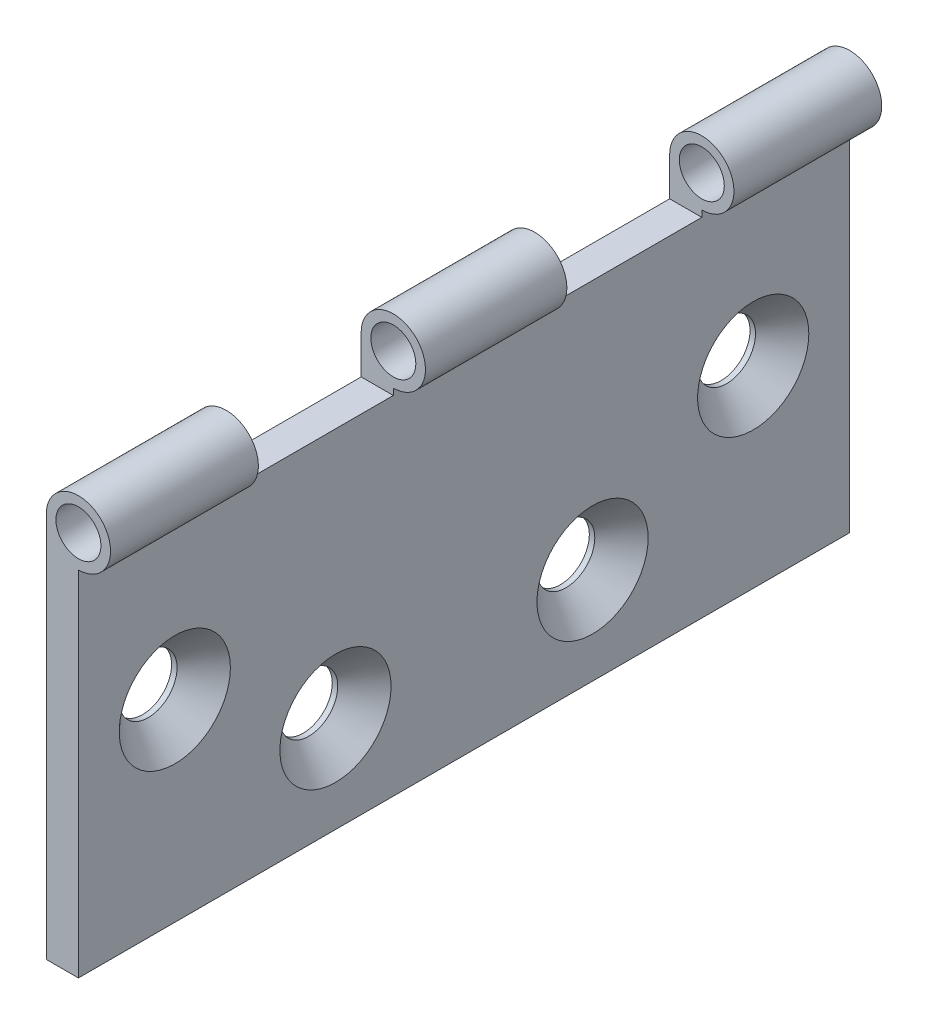
ISO-10303-21;
HEADER;
FILE_DESCRIPTION(('STEP AP214'),'2;1');
FILE_NAME('part.step','',(''),(''),'','','');
FILE_SCHEMA(('AUTOMOTIVE_DESIGN { 1 0 10303 214 1 1 1 1 }'));
ENDSEC;
DATA;
#1=APPLICATION_CONTEXT('core data for automotive mechanical design processes');
#2=APPLICATION_PROTOCOL_DEFINITION('international standard','automotive_design',2000,#1);
#3=PRODUCT_CONTEXT('',#1,'mechanical');
#4=PRODUCT('Part','Part','',(#3));
#5=PRODUCT_RELATED_PRODUCT_CATEGORY('part','',(#4));
#6=PRODUCT_DEFINITION_FORMATION('','',#4);
#7=PRODUCT_DEFINITION_CONTEXT('part definition',#1,'design');
#8=PRODUCT_DEFINITION('design','',#6,#7);
#9=PRODUCT_DEFINITION_SHAPE('','',#8);
#10=(LENGTH_UNIT() NAMED_UNIT(*) SI_UNIT(.MILLI.,.METRE.));
#11=(NAMED_UNIT(*) PLANE_ANGLE_UNIT() SI_UNIT($,.RADIAN.));
#12=(NAMED_UNIT(*) SI_UNIT($,.STERADIAN.) SOLID_ANGLE_UNIT());
#13=UNCERTAINTY_MEASURE_WITH_UNIT(LENGTH_MEASURE(1.E-05),#10,'distance_accuracy_value','');
#14=(GEOMETRIC_REPRESENTATION_CONTEXT(3) GLOBAL_UNCERTAINTY_ASSIGNED_CONTEXT((#13)) GLOBAL_UNIT_ASSIGNED_CONTEXT((#10,
#11,#12)) REPRESENTATION_CONTEXT('',''));
#15=CARTESIAN_POINT('',(0.,0.,0.));
#16=DIRECTION('',(0.,0.,1.));
#17=DIRECTION('',(1.,0.,0.));
#18=AXIS2_PLACEMENT_3D('',#15,#16,#17);
#19=CARTESIAN_POINT('',(5.,60.,60.));
#20=DIRECTION('',(0.,0.,-1.));
#21=DIRECTION('',(-1.,0.,0.));
#22=AXIS2_PLACEMENT_3D('',#19,#20,#21);
#23=CYLINDRICAL_SURFACE('',#22,5.);
#24=CARTESIAN_POINT('',(5.,60.,-37.));
#25=DIRECTION('',(0.,0.,-1.));
#26=DIRECTION('',(-1.,0.,0.));
#27=AXIS2_PLACEMENT_3D('',#24,#25,#26);
#28=CIRCLE('',#27,5.);
#29=CARTESIAN_POINT('',(5.,55.,-37.));
#30=VERTEX_POINT('',#29);
#31=CARTESIAN_POINT('',(0.,60.,-37.));
#32=VERTEX_POINT('',#31);
#33=EDGE_CURVE('E139',#30,#32,#28,.F.);
#34=ORIENTED_EDGE('',*,*,#33,.F.);
#35=DIRECTION('',(0.,0.,-1.));
#36=VECTOR('',#35,1.);
#37=CARTESIAN_POINT('',(5.,55.,60.));
#38=LINE('',#37,#36);
#39=CARTESIAN_POINT('',(5.,55.,-60.));
#40=VERTEX_POINT('',#39);
#41=EDGE_CURVE('E94',#40,#30,#38,.F.);
#42=ORIENTED_EDGE('',*,*,#41,.F.);
#43=CARTESIAN_POINT('',(5.,60.,-60.));
#44=DIRECTION('',(0.,0.,-1.));
#45=DIRECTION('',(-1.,0.,0.));
#46=AXIS2_PLACEMENT_3D('',#43,#44,#45);
#47=CIRCLE('',#46,5.);
#48=CARTESIAN_POINT('',(0.,60.,-60.));
#49=VERTEX_POINT('',#48);
#50=EDGE_CURVE('E92',#49,#40,#47,.T.);
#51=ORIENTED_EDGE('',*,*,#50,.F.);
#52=DIRECTION('',(0.,0.,-1.));
#53=VECTOR('',#52,1.);
#54=CARTESIAN_POINT('',(0.,60.,60.));
#55=LINE('',#54,#53);
#56=EDGE_CURVE('E44',#32,#49,#55,.T.);
#57=ORIENTED_EDGE('',*,*,#56,.F.);
#58=EDGE_LOOP('',(#34,#42,#51,#57));
#59=FACE_BOUND('',#58,.T.);
#60=ADVANCED_FACE('F33',(#59),#23,.T.);
#61=CARTESIAN_POINT('',(5.,60.,-60.));
#62=DIRECTION('',(0.,0.,1.));
#63=DIRECTION('',(1.,0.,0.));
#64=AXIS2_PLACEMENT_3D('',#61,#62,#63);
#65=CYLINDRICAL_SURFACE('',#64,3.5);
#66=CARTESIAN_POINT('',(5.,60.,-37.));
#67=DIRECTION('',(0.,0.,-1.));
#68=DIRECTION('',(-1.,0.,0.));
#69=AXIS2_PLACEMENT_3D('',#66,#67,#68);
#70=CIRCLE('',#69,3.5);
#71=CARTESIAN_POINT('',(1.5,60.,-37.));
#72=VERTEX_POINT('',#71);
#73=EDGE_CURVE('E37',#72,#72,#70,.F.);
#74=ORIENTED_EDGE('',*,*,#73,.T.);
#75=EDGE_LOOP('',(#74));
#76=FACE_BOUND('',#75,.T.);
#77=CARTESIAN_POINT('',(5.,60.,-60.));
#78=DIRECTION('',(0.,0.,1.));
#79=DIRECTION('',(1.,0.,0.));
#80=AXIS2_PLACEMENT_3D('',#77,#78,#79);
#81=CIRCLE('',#80,3.5);
#82=CARTESIAN_POINT('',(8.5,60.,-60.));
#83=VERTEX_POINT('',#82);
#84=EDGE_CURVE('E208',#83,#83,#81,.T.);
#85=ORIENTED_EDGE('',*,*,#84,.F.);
#86=EDGE_LOOP('',(#85));
#87=FACE_BOUND('',#86,.T.);
#88=ADVANCED_FACE('F315',(#76,#87),#65,.F.);
#89=CARTESIAN_POINT('',(5.,55.,-11.));
#90=VERTEX_POINT('',#89);
#91=CARTESIAN_POINT('',(5.,55.,11.));
#92=VERTEX_POINT('',#91);
#93=EDGE_CURVE('E218',#90,#92,#38,.F.);
#94=ORIENTED_EDGE('',*,*,#93,.F.);
#95=CARTESIAN_POINT('',(5.,60.,-11.));
#96=DIRECTION('',(0.,0.,1.));
#97=DIRECTION('',(1.,0.,0.));
#98=AXIS2_PLACEMENT_3D('',#95,#96,#97);
#99=CIRCLE('',#98,5.);
#100=CARTESIAN_POINT('',(0.,60.,-11.));
#101=VERTEX_POINT('',#100);
#102=EDGE_CURVE('E120',#101,#90,#99,.F.);
#103=ORIENTED_EDGE('',*,*,#102,.F.);
#104=CARTESIAN_POINT('',(0.,60.,11.));
#105=VERTEX_POINT('',#104);
#106=EDGE_CURVE('E42',#105,#101,#55,.T.);
#107=ORIENTED_EDGE('',*,*,#106,.F.);
#108=CARTESIAN_POINT('',(5.,60.,11.));
#109=DIRECTION('',(0.,0.,-1.));
#110=DIRECTION('',(-1.,0.,0.));
#111=AXIS2_PLACEMENT_3D('',#108,#109,#110);
#112=CIRCLE('',#111,5.);
#113=EDGE_CURVE('E107',#92,#105,#112,.F.);
#114=ORIENTED_EDGE('',*,*,#113,.F.);
#115=EDGE_LOOP('',(#94,#103,#107,#114));
#116=FACE_BOUND('',#115,.T.);
#117=ADVANCED_FACE('F281',(#116),#23,.T.);
#118=CARTESIAN_POINT('',(5.,60.,37.));
#119=DIRECTION('',(0.,0.,1.));
#120=DIRECTION('',(1.,0.,0.));
#121=AXIS2_PLACEMENT_3D('',#118,#119,#120);
#122=CIRCLE('',#121,3.5);
#123=CARTESIAN_POINT('',(8.5,60.,37.));
#124=VERTEX_POINT('',#123);
#125=EDGE_CURVE('E109',#124,#124,#122,.F.);
#126=ORIENTED_EDGE('',*,*,#125,.T.);
#127=EDGE_LOOP('',(#126));
#128=FACE_BOUND('',#127,.T.);
#129=CARTESIAN_POINT('',(5.,60.,60.));
#130=DIRECTION('',(0.,0.,1.));
#131=DIRECTION('',(1.,0.,0.));
#132=AXIS2_PLACEMENT_3D('',#129,#130,#131);
#133=CIRCLE('',#132,3.5);
#134=CARTESIAN_POINT('',(8.5,60.,60.));
#135=VERTEX_POINT('',#134);
#136=EDGE_CURVE('E207',#135,#135,#133,.T.);
#137=ORIENTED_EDGE('',*,*,#136,.T.);
#138=EDGE_LOOP('',(#137));
#139=FACE_BOUND('',#138,.T.);
#140=ADVANCED_FACE('F322',(#128,#139),#65,.F.);
#141=CARTESIAN_POINT('',(5.,0.,60.));
#142=DIRECTION('',(-1.,0.,0.));
#143=DIRECTION('',(0.,0.,1.));
#144=AXIS2_PLACEMENT_3D('',#141,#142,#143);
#145=PLANE('',#144);
#146=CARTESIAN_POINT('',(5.,30.,-45.));
#147=DIRECTION('',(1.,0.,0.));
#148=DIRECTION('',(0.,0.,-1.));
#149=AXIS2_PLACEMENT_3D('',#146,#147,#148);
#150=CIRCLE('',#149,8.65);
#151=CARTESIAN_POINT('',(5.,30.,-53.65));
#152=VERTEX_POINT('',#151);
#153=EDGE_CURVE('E171',#152,#152,#150,.T.);
#154=ORIENTED_EDGE('',*,*,#153,.F.);
#155=EDGE_LOOP('',(#154));
#156=FACE_BOUND('',#155,.T.);
#157=CARTESIAN_POINT('',(5.,15.,-20.));
#158=DIRECTION('',(1.,0.,0.));
#159=DIRECTION('',(0.,0.,-1.));
#160=AXIS2_PLACEMENT_3D('',#157,#158,#159);
#161=CIRCLE('',#160,8.65);
#162=CARTESIAN_POINT('',(5.,15.,-28.65));
#163=VERTEX_POINT('',#162);
#164=EDGE_CURVE('E180',#163,#163,#161,.T.);
#165=ORIENTED_EDGE('',*,*,#164,.F.);
#166=EDGE_LOOP('',(#165));
#167=FACE_BOUND('',#166,.T.);
#168=CARTESIAN_POINT('',(5.,30.,45.));
#169=DIRECTION('',(1.,0.,0.));
#170=DIRECTION('',(0.,0.,-1.));
#171=AXIS2_PLACEMENT_3D('',#168,#169,#170);
#172=CIRCLE('',#171,8.65);
#173=CARTESIAN_POINT('',(5.,30.,36.35));
#174=VERTEX_POINT('',#173);
#175=EDGE_CURVE('E189',#174,#174,#172,.T.);
#176=ORIENTED_EDGE('',*,*,#175,.F.);
#177=EDGE_LOOP('',(#176));
#178=FACE_BOUND('',#177,.T.);
#179=CARTESIAN_POINT('',(5.,15.,20.));
#180=DIRECTION('',(1.,0.,0.));
#181=DIRECTION('',(0.,0.,-1.));
#182=AXIS2_PLACEMENT_3D('',#179,#180,#181);
#183=CIRCLE('',#182,8.65);
#184=CARTESIAN_POINT('',(5.,15.,11.35));
#185=VERTEX_POINT('',#184);
#186=EDGE_CURVE('E198',#185,#185,#183,.T.);
#187=ORIENTED_EDGE('',*,*,#186,.F.);
#188=EDGE_LOOP('',(#187));
#189=FACE_BOUND('',#188,.T.);
#190=ORIENTED_EDGE('',*,*,#41,.T.);
#191=DIRECTION('',(0.,-1.,0.));
#192=VECTOR('',#191,1.);
#193=CARTESIAN_POINT('',(5.,0.,-37.));
#194=LINE('',#193,#192);
#195=CARTESIAN_POINT('',(5.,54.,-37.));
#196=VERTEX_POINT('',#195);
#197=EDGE_CURVE('E137',#30,#196,#194,.T.);
#198=ORIENTED_EDGE('',*,*,#197,.T.);
#199=DIRECTION('',(0.,0.,1.));
#200=VECTOR('',#199,1.);
#201=CARTESIAN_POINT('',(5.,54.,60.));
#202=LINE('',#201,#200);
#203=CARTESIAN_POINT('',(5.,54.,-11.));
#204=VERTEX_POINT('',#203);
#205=EDGE_CURVE('E142',#196,#204,#202,.T.);
#206=ORIENTED_EDGE('',*,*,#205,.T.);
#207=DIRECTION('',(0.,1.,0.));
#208=VECTOR('',#207,1.);
#209=CARTESIAN_POINT('',(5.,0.,-11.));
#210=LINE('',#209,#208);
#211=EDGE_CURVE('E115',#204,#90,#210,.T.);
#212=ORIENTED_EDGE('',*,*,#211,.T.);
#213=ORIENTED_EDGE('',*,*,#93,.T.);
#214=DIRECTION('',(0.,-1.,0.));
#215=VECTOR('',#214,1.);
#216=CARTESIAN_POINT('',(5.,0.,11.));
#217=LINE('',#216,#215);
#218=CARTESIAN_POINT('',(5.,54.,11.));
#219=VERTEX_POINT('',#218);
#220=EDGE_CURVE('E112',#92,#219,#217,.T.);
#221=ORIENTED_EDGE('',*,*,#220,.T.);
#222=DIRECTION('',(0.,0.,1.));
#223=VECTOR('',#222,1.);
#224=CARTESIAN_POINT('',(5.,54.,60.));
#225=LINE('',#224,#223);
#226=CARTESIAN_POINT('',(5.,54.,37.));
#227=VERTEX_POINT('',#226);
#228=EDGE_CURVE('E168',#219,#227,#225,.T.);
#229=ORIENTED_EDGE('',*,*,#228,.T.);
#230=DIRECTION('',(0.,1.,0.));
#231=VECTOR('',#230,1.);
#232=CARTESIAN_POINT('',(5.,0.,37.));
#233=LINE('',#232,#231);
#234=CARTESIAN_POINT('',(5.,55.,37.));
#235=VERTEX_POINT('',#234);
#236=EDGE_CURVE('E165',#227,#235,#233,.T.);
#237=ORIENTED_EDGE('',*,*,#236,.T.);
#238=CARTESIAN_POINT('',(5.,55.,60.));
#239=VERTEX_POINT('',#238);
#240=EDGE_CURVE('E216',#235,#239,#38,.F.);
#241=ORIENTED_EDGE('',*,*,#240,.T.);
#242=DIRECTION('',(0.,1.,0.));
#243=VECTOR('',#242,1.);
#244=CARTESIAN_POINT('',(5.,0.,60.));
#245=LINE('',#244,#243);
#246=CARTESIAN_POINT('',(5.,0.,60.));
#247=VERTEX_POINT('',#246);
#248=EDGE_CURVE('E80',#247,#239,#245,.T.);
#249=ORIENTED_EDGE('',*,*,#248,.F.);
#250=DIRECTION('',(0.,0.,-1.));
#251=VECTOR('',#250,1.);
#252=CARTESIAN_POINT('',(5.,0.,60.));
#253=LINE('',#252,#251);
#254=CARTESIAN_POINT('',(5.,0.,-60.));
#255=VERTEX_POINT('',#254);
#256=EDGE_CURVE('E60',#247,#255,#253,.T.);
#257=ORIENTED_EDGE('',*,*,#256,.T.);
#258=DIRECTION('',(0.,1.,0.));
#259=VECTOR('',#258,1.);
#260=CARTESIAN_POINT('',(5.,0.,-60.));
#261=LINE('',#260,#259);
#262=EDGE_CURVE('E77',#255,#40,#261,.T.);
#263=ORIENTED_EDGE('',*,*,#262,.T.);
#264=EDGE_LOOP('',(#190,#198,#206,#212,#213,#221,#229,#237,#241,#249,#257,#263));
#265=FACE_BOUND('',#264,.T.);
#266=ADVANCED_FACE('F35',(#156,#167,#178,#189,#265),#145,.F.);
#267=CARTESIAN_POINT('',(0.,0.,60.));
#268=DIRECTION('',(-1.,0.,0.));
#269=DIRECTION('',(0.,0.,1.));
#270=AXIS2_PLACEMENT_3D('',#267,#268,#269);
#271=PLANE('',#270);
#272=DIRECTION('',(0.,1.,0.));
#273=VECTOR('',#272,1.);
#274=CARTESIAN_POINT('',(0.,65.,-37.));
#275=LINE('',#274,#273);
#276=CARTESIAN_POINT('',(0.,54.,-37.));
#277=VERTEX_POINT('',#276);
#278=EDGE_CURVE('E130',#277,#32,#275,.T.);
#279=ORIENTED_EDGE('',*,*,#278,.T.);
#280=ORIENTED_EDGE('',*,*,#56,.T.);
#281=DIRECTION('',(0.,1.,0.));
#282=VECTOR('',#281,1.);
#283=CARTESIAN_POINT('',(0.,0.,-60.));
#284=LINE('',#283,#282);
#285=CARTESIAN_POINT('',(0.,0.,-60.));
#286=VERTEX_POINT('',#285);
#287=EDGE_CURVE('E93',#286,#49,#284,.T.);
#288=ORIENTED_EDGE('',*,*,#287,.F.);
#289=DIRECTION('',(0.,0.,-1.));
#290=VECTOR('',#289,1.);
#291=CARTESIAN_POINT('',(0.,0.,60.));
#292=LINE('',#291,#290);
#293=CARTESIAN_POINT('',(0.,0.,60.));
#294=VERTEX_POINT('',#293);
#295=EDGE_CURVE('E82',#294,#286,#292,.T.);
#296=ORIENTED_EDGE('',*,*,#295,.F.);
#297=DIRECTION('',(0.,1.,0.));
#298=VECTOR('',#297,1.);
#299=CARTESIAN_POINT('',(0.,0.,60.));
#300=LINE('',#299,#298);
#301=CARTESIAN_POINT('',(0.,60.,60.));
#302=VERTEX_POINT('',#301);
#303=EDGE_CURVE('E99',#294,#302,#300,.T.);
#304=ORIENTED_EDGE('',*,*,#303,.T.);
#305=CARTESIAN_POINT('',(0.,60.,37.));
#306=VERTEX_POINT('',#305);
#307=EDGE_CURVE('E11',#302,#306,#55,.T.);
#308=ORIENTED_EDGE('',*,*,#307,.T.);
#309=DIRECTION('',(0.,-1.,0.));
#310=VECTOR('',#309,1.);
#311=CARTESIAN_POINT('',(0.,65.,37.));
#312=LINE('',#311,#310);
#313=CARTESIAN_POINT('',(0.,54.,37.));
#314=VERTEX_POINT('',#313);
#315=EDGE_CURVE('E145',#306,#314,#312,.T.);
#316=ORIENTED_EDGE('',*,*,#315,.T.);
#317=DIRECTION('',(0.,0.,-1.));
#318=VECTOR('',#317,1.);
#319=CARTESIAN_POINT('',(0.,54.,11.));
#320=LINE('',#319,#318);
#321=CARTESIAN_POINT('',(0.,54.,11.));
#322=VERTEX_POINT('',#321);
#323=EDGE_CURVE('E148',#314,#322,#320,.T.);
#324=ORIENTED_EDGE('',*,*,#323,.T.);
#325=DIRECTION('',(0.,1.,0.));
#326=VECTOR('',#325,1.);
#327=CARTESIAN_POINT('',(0.,65.,11.));
#328=LINE('',#327,#326);
#329=EDGE_CURVE('E151',#322,#105,#328,.T.);
#330=ORIENTED_EDGE('',*,*,#329,.T.);
#331=ORIENTED_EDGE('',*,*,#106,.T.);
#332=DIRECTION('',(0.,-1.,0.));
#333=VECTOR('',#332,1.);
#334=CARTESIAN_POINT('',(0.,65.,-11.));
#335=LINE('',#334,#333);
#336=CARTESIAN_POINT('',(0.,54.,-11.));
#337=VERTEX_POINT('',#336);
#338=EDGE_CURVE('E291',#101,#337,#335,.T.);
#339=ORIENTED_EDGE('',*,*,#338,.T.);
#340=DIRECTION('',(0.,0.,-1.));
#341=VECTOR('',#340,1.);
#342=CARTESIAN_POINT('',(0.,54.,-37.));
#343=LINE('',#342,#341);
#344=EDGE_CURVE('E51',#337,#277,#343,.T.);
#345=ORIENTED_EDGE('',*,*,#344,.T.);
#346=EDGE_LOOP('',(#279,#280,#288,#296,#304,#308,#316,#324,#330,#331,#339,#345));
#347=FACE_BOUND('',#346,.T.);
#348=CARTESIAN_POINT('',(0.,30.,-45.));
#349=DIRECTION('',(1.,0.,0.));
#350=DIRECTION('',(0.,0.,-1.));
#351=AXIS2_PLACEMENT_3D('',#348,#349,#350);
#352=CIRCLE('',#351,4.5);
#353=CARTESIAN_POINT('',(0.,30.,-49.5));
#354=VERTEX_POINT('',#353);
#355=EDGE_CURVE('E177',#354,#354,#352,.T.);
#356=ORIENTED_EDGE('',*,*,#355,.T.);
#357=EDGE_LOOP('',(#356));
#358=FACE_BOUND('',#357,.T.);
#359=CARTESIAN_POINT('',(0.,15.,-20.));
#360=DIRECTION('',(1.,0.,0.));
#361=DIRECTION('',(0.,0.,-1.));
#362=AXIS2_PLACEMENT_3D('',#359,#360,#361);
#363=CIRCLE('',#362,4.5);
#364=CARTESIAN_POINT('',(0.,15.,-24.5));
#365=VERTEX_POINT('',#364);
#366=EDGE_CURVE('E186',#365,#365,#363,.T.);
#367=ORIENTED_EDGE('',*,*,#366,.T.);
#368=EDGE_LOOP('',(#367));
#369=FACE_BOUND('',#368,.T.);
#370=CARTESIAN_POINT('',(0.,30.,45.));
#371=DIRECTION('',(1.,0.,0.));
#372=DIRECTION('',(0.,0.,-1.));
#373=AXIS2_PLACEMENT_3D('',#370,#371,#372);
#374=CIRCLE('',#373,4.5);
#375=CARTESIAN_POINT('',(0.,30.,40.5));
#376=VERTEX_POINT('',#375);
#377=EDGE_CURVE('E195',#376,#376,#374,.T.);
#378=ORIENTED_EDGE('',*,*,#377,.T.);
#379=EDGE_LOOP('',(#378));
#380=FACE_BOUND('',#379,.T.);
#381=CARTESIAN_POINT('',(0.,15.,20.));
#382=DIRECTION('',(1.,0.,0.));
#383=DIRECTION('',(0.,0.,-1.));
#384=AXIS2_PLACEMENT_3D('',#381,#382,#383);
#385=CIRCLE('',#384,4.5);
#386=CARTESIAN_POINT('',(0.,15.,15.5));
#387=VERTEX_POINT('',#386);
#388=EDGE_CURVE('E204',#387,#387,#385,.T.);
#389=ORIENTED_EDGE('',*,*,#388,.T.);
#390=EDGE_LOOP('',(#389));
#391=FACE_BOUND('',#390,.T.);
#392=ADVANCED_FACE('F230',(#347,#358,#369,#380,#391),#271,.T.);
#393=CARTESIAN_POINT('',(5.,0.,60.));
#394=DIRECTION('',(0.,-1.,0.));
#395=DIRECTION('',(0.,0.,-1.));
#396=AXIS2_PLACEMENT_3D('',#393,#394,#395);
#397=PLANE('',#396);
#398=DIRECTION('',(-1.,0.,0.));
#399=VECTOR('',#398,1.);
#400=CARTESIAN_POINT('',(5.,0.,-60.));
#401=LINE('',#400,#399);
#402=EDGE_CURVE('E90',#255,#286,#401,.T.);
#403=ORIENTED_EDGE('',*,*,#402,.F.);
#404=ORIENTED_EDGE('',*,*,#256,.F.);
#405=DIRECTION('',(-1.,0.,0.));
#406=VECTOR('',#405,1.);
#407=CARTESIAN_POINT('',(5.,0.,60.));
#408=LINE('',#407,#406);
#409=EDGE_CURVE('E83',#247,#294,#408,.T.);
#410=ORIENTED_EDGE('',*,*,#409,.T.);
#411=ORIENTED_EDGE('',*,*,#295,.T.);
#412=EDGE_LOOP('',(#403,#404,#410,#411));
#413=FACE_BOUND('',#412,.T.);
#414=ADVANCED_FACE('F96',(#413),#397,.T.);
#415=CARTESIAN_POINT('',(0.,0.,60.));
#416=DIRECTION('',(0.,0.,-1.));
#417=DIRECTION('',(-1.,0.,0.));
#418=AXIS2_PLACEMENT_3D('',#415,#416,#417);
#419=PLANE('',#418);
#420=ORIENTED_EDGE('',*,*,#136,.F.);
#421=EDGE_LOOP('',(#420));
#422=FACE_BOUND('',#421,.T.);
#423=ORIENTED_EDGE('',*,*,#248,.T.);
#424=CARTESIAN_POINT('',(5.,60.,60.));
#425=DIRECTION('',(0.,0.,-1.));
#426=DIRECTION('',(-1.,0.,0.));
#427=AXIS2_PLACEMENT_3D('',#424,#425,#426);
#428=CIRCLE('',#427,5.);
#429=EDGE_CURVE('E213',#302,#239,#428,.T.);
#430=ORIENTED_EDGE('',*,*,#429,.F.);
#431=ORIENTED_EDGE('',*,*,#303,.F.);
#432=ORIENTED_EDGE('',*,*,#409,.F.);
#433=EDGE_LOOP('',(#423,#430,#431,#432));
#434=FACE_BOUND('',#433,.T.);
#435=ADVANCED_FACE('F224',(#422,#434),#419,.F.);
#436=CARTESIAN_POINT('',(0.,0.,-60.));
#437=DIRECTION('',(0.,0.,-1.));
#438=DIRECTION('',(-1.,0.,0.));
#439=AXIS2_PLACEMENT_3D('',#436,#437,#438);
#440=PLANE('',#439);
#441=ORIENTED_EDGE('',*,*,#84,.T.);
#442=EDGE_LOOP('',(#441));
#443=FACE_BOUND('',#442,.T.);
#444=ORIENTED_EDGE('',*,*,#287,.T.);
#445=ORIENTED_EDGE('',*,*,#50,.T.);
#446=ORIENTED_EDGE('',*,*,#262,.F.);
#447=ORIENTED_EDGE('',*,*,#402,.T.);
#448=EDGE_LOOP('',(#444,#445,#446,#447));
#449=FACE_BOUND('',#448,.T.);
#450=ADVANCED_FACE('F89',(#443,#449),#440,.T.);
#451=ORIENTED_EDGE('',*,*,#240,.F.);
#452=CARTESIAN_POINT('',(5.,60.,37.));
#453=DIRECTION('',(0.,0.,1.));
#454=DIRECTION('',(1.,0.,0.));
#455=AXIS2_PLACEMENT_3D('',#452,#453,#454);
#456=CIRCLE('',#455,5.);
#457=EDGE_CURVE('E111',#306,#235,#456,.F.);
#458=ORIENTED_EDGE('',*,*,#457,.F.);
#459=ORIENTED_EDGE('',*,*,#307,.F.);
#460=ORIENTED_EDGE('',*,*,#429,.T.);
#461=EDGE_LOOP('',(#451,#458,#459,#460));
#462=FACE_BOUND('',#461,.T.);
#463=ADVANCED_FACE('F272',(#462),#23,.T.);
#464=CARTESIAN_POINT('',(5.,60.,-11.));
#465=DIRECTION('',(0.,0.,1.));
#466=DIRECTION('',(1.,0.,0.));
#467=AXIS2_PLACEMENT_3D('',#464,#465,#466);
#468=CIRCLE('',#467,3.5);
#469=CARTESIAN_POINT('',(8.5,60.,-11.));
#470=VERTEX_POINT('',#469);
#471=EDGE_CURVE('E113',#470,#470,#468,.F.);
#472=ORIENTED_EDGE('',*,*,#471,.T.);
#473=EDGE_LOOP('',(#472));
#474=FACE_BOUND('',#473,.T.);
#475=CARTESIAN_POINT('',(5.,60.,11.));
#476=DIRECTION('',(0.,0.,-1.));
#477=DIRECTION('',(-1.,0.,0.));
#478=AXIS2_PLACEMENT_3D('',#475,#476,#477);
#479=CIRCLE('',#478,3.5);
#480=CARTESIAN_POINT('',(1.5,60.,11.));
#481=VERTEX_POINT('',#480);
#482=EDGE_CURVE('E104',#481,#481,#479,.F.);
#483=ORIENTED_EDGE('',*,*,#482,.T.);
#484=EDGE_LOOP('',(#483));
#485=FACE_BOUND('',#484,.T.);
#486=ADVANCED_FACE('F323',(#474,#485),#65,.F.);
#487=CARTESIAN_POINT('',(5.,15.,20.));
#488=DIRECTION('',(1.,0.,0.));
#489=DIRECTION('',(0.,0.,-1.));
#490=AXIS2_PLACEMENT_3D('',#487,#488,#489);
#491=CYLINDRICAL_SURFACE('',#490,4.5);
#492=ORIENTED_EDGE('',*,*,#388,.F.);
#493=EDGE_LOOP('',(#492));
#494=FACE_BOUND('',#493,.T.);
#495=CARTESIAN_POINT('',(0.850000000000013,15.,20.));
#496=DIRECTION('',(1.,0.,0.));
#497=DIRECTION('',(0.,0.,-1.));
#498=AXIS2_PLACEMENT_3D('',#495,#496,#497);
#499=CIRCLE('',#498,4.49999999999999);
#500=CARTESIAN_POINT('',(0.850000000000013,15.,15.5));
#501=VERTEX_POINT('',#500);
#502=EDGE_CURVE('E201',#501,#501,#499,.T.);
#503=ORIENTED_EDGE('',*,*,#502,.T.);
#504=EDGE_LOOP('',(#503));
#505=FACE_BOUND('',#504,.T.);
#506=ADVANCED_FACE('F331',(#494,#505),#491,.F.);
#507=CARTESIAN_POINT('',(5.,15.,20.));
#508=DIRECTION('',(1.,0.,0.));
#509=DIRECTION('',(0.,0.,-1.));
#510=AXIS2_PLACEMENT_3D('',#507,#508,#509);
#511=CONICAL_SURFACE('',#510,8.65,0.785398163397451);
#512=ORIENTED_EDGE('',*,*,#502,.F.);
#513=EDGE_LOOP('',(#512));
#514=FACE_BOUND('',#513,.T.);
#515=ORIENTED_EDGE('',*,*,#186,.T.);
#516=EDGE_LOOP('',(#515));
#517=FACE_BOUND('',#516,.T.);
#518=ADVANCED_FACE('F357',(#514,#517),#511,.F.);
#519=CARTESIAN_POINT('',(5.,30.,45.));
#520=DIRECTION('',(1.,0.,0.));
#521=DIRECTION('',(0.,0.,-1.));
#522=AXIS2_PLACEMENT_3D('',#519,#520,#521);
#523=CYLINDRICAL_SURFACE('',#522,4.49999999999999);
#524=ORIENTED_EDGE('',*,*,#377,.F.);
#525=EDGE_LOOP('',(#524));
#526=FACE_BOUND('',#525,.T.);
#527=CARTESIAN_POINT('',(0.850000000000013,30.,45.));
#528=DIRECTION('',(1.,0.,0.));
#529=DIRECTION('',(0.,0.,-1.));
#530=AXIS2_PLACEMENT_3D('',#527,#528,#529);
#531=CIRCLE('',#530,4.49999999999999);
#532=CARTESIAN_POINT('',(0.850000000000013,30.,40.5));
#533=VERTEX_POINT('',#532);
#534=EDGE_CURVE('E192',#533,#533,#531,.T.);
#535=ORIENTED_EDGE('',*,*,#534,.T.);
#536=EDGE_LOOP('',(#535));
#537=FACE_BOUND('',#536,.T.);
#538=ADVANCED_FACE('F359',(#526,#537),#523,.F.);
#539=CARTESIAN_POINT('',(5.,30.,45.));
#540=DIRECTION('',(1.,0.,0.));
#541=DIRECTION('',(0.,0.,-1.));
#542=AXIS2_PLACEMENT_3D('',#539,#540,#541);
#543=CONICAL_SURFACE('',#542,8.65,0.785398163397451);
#544=ORIENTED_EDGE('',*,*,#534,.F.);
#545=EDGE_LOOP('',(#544));
#546=FACE_BOUND('',#545,.T.);
#547=ORIENTED_EDGE('',*,*,#175,.T.);
#548=EDGE_LOOP('',(#547));
#549=FACE_BOUND('',#548,.T.);
#550=ADVANCED_FACE('F366',(#546,#549),#543,.F.);
#551=CARTESIAN_POINT('',(5.,15.,-20.));
#552=DIRECTION('',(1.,0.,0.));
#553=DIRECTION('',(0.,0.,-1.));
#554=AXIS2_PLACEMENT_3D('',#551,#552,#553);
#555=CYLINDRICAL_SURFACE('',#554,4.5);
#556=ORIENTED_EDGE('',*,*,#366,.F.);
#557=EDGE_LOOP('',(#556));
#558=FACE_BOUND('',#557,.T.);
#559=CARTESIAN_POINT('',(0.850000000000013,15.,-20.));
#560=DIRECTION('',(1.,0.,0.));
#561=DIRECTION('',(0.,0.,-1.));
#562=AXIS2_PLACEMENT_3D('',#559,#560,#561);
#563=CIRCLE('',#562,4.49999999999999);
#564=CARTESIAN_POINT('',(0.850000000000013,15.,-24.5));
#565=VERTEX_POINT('',#564);
#566=EDGE_CURVE('E183',#565,#565,#563,.T.);
#567=ORIENTED_EDGE('',*,*,#566,.T.);
#568=EDGE_LOOP('',(#567));
#569=FACE_BOUND('',#568,.T.);
#570=ADVANCED_FACE('F375',(#558,#569),#555,.F.);
#571=CARTESIAN_POINT('',(5.,15.,-20.));
#572=DIRECTION('',(1.,0.,0.));
#573=DIRECTION('',(0.,0.,-1.));
#574=AXIS2_PLACEMENT_3D('',#571,#572,#573);
#575=CONICAL_SURFACE('',#574,8.65,0.785398163397451);
#576=ORIENTED_EDGE('',*,*,#566,.F.);
#577=EDGE_LOOP('',(#576));
#578=FACE_BOUND('',#577,.T.);
#579=ORIENTED_EDGE('',*,*,#164,.T.);
#580=EDGE_LOOP('',(#579));
#581=FACE_BOUND('',#580,.T.);
#582=ADVANCED_FACE('F379',(#578,#581),#575,.F.);
#583=CARTESIAN_POINT('',(5.,30.,-45.));
#584=DIRECTION('',(1.,0.,0.));
#585=DIRECTION('',(0.,0.,-1.));
#586=AXIS2_PLACEMENT_3D('',#583,#584,#585);
#587=CYLINDRICAL_SURFACE('',#586,4.49999999999999);
#588=ORIENTED_EDGE('',*,*,#355,.F.);
#589=EDGE_LOOP('',(#588));
#590=FACE_BOUND('',#589,.T.);
#591=CARTESIAN_POINT('',(0.850000000000013,30.,-45.));
#592=DIRECTION('',(1.,0.,0.));
#593=DIRECTION('',(0.,0.,-1.));
#594=AXIS2_PLACEMENT_3D('',#591,#592,#593);
#595=CIRCLE('',#594,4.49999999999999);
#596=CARTESIAN_POINT('',(0.850000000000013,30.,-49.5));
#597=VERTEX_POINT('',#596);
#598=EDGE_CURVE('E174',#597,#597,#595,.T.);
#599=ORIENTED_EDGE('',*,*,#598,.T.);
#600=EDGE_LOOP('',(#599));
#601=FACE_BOUND('',#600,.T.);
#602=ADVANCED_FACE('F383',(#590,#601),#587,.F.);
#603=CARTESIAN_POINT('',(5.,30.,-45.));
#604=DIRECTION('',(1.,0.,0.));
#605=DIRECTION('',(0.,0.,-1.));
#606=AXIS2_PLACEMENT_3D('',#603,#604,#605);
#607=CONICAL_SURFACE('',#606,8.65,0.785398163397451);
#608=ORIENTED_EDGE('',*,*,#598,.F.);
#609=EDGE_LOOP('',(#608));
#610=FACE_BOUND('',#609,.T.);
#611=ORIENTED_EDGE('',*,*,#153,.T.);
#612=EDGE_LOOP('',(#611));
#613=FACE_BOUND('',#612,.T.);
#614=ADVANCED_FACE('F387',(#610,#613),#607,.F.);
#615=CARTESIAN_POINT('',(0.,54.,11.));
#616=DIRECTION('',(0.,-1.,0.));
#617=DIRECTION('',(0.,0.,-1.));
#618=AXIS2_PLACEMENT_3D('',#615,#616,#617);
#619=PLANE('',#618);
#620=DIRECTION('',(1.,0.,0.));
#621=VECTOR('',#620,1.);
#622=CARTESIAN_POINT('',(0.,54.,11.));
#623=LINE('',#622,#621);
#624=EDGE_CURVE('E108',#322,#219,#623,.T.);
#625=ORIENTED_EDGE('',*,*,#624,.F.);
#626=ORIENTED_EDGE('',*,*,#323,.F.);
#627=DIRECTION('',(1.,0.,0.));
#628=VECTOR('',#627,1.);
#629=CARTESIAN_POINT('',(0.,54.,37.));
#630=LINE('',#629,#628);
#631=EDGE_CURVE('E154',#314,#227,#630,.T.);
#632=ORIENTED_EDGE('',*,*,#631,.T.);
#633=ORIENTED_EDGE('',*,*,#228,.F.);
#634=EDGE_LOOP('',(#625,#626,#632,#633));
#635=FACE_BOUND('',#634,.T.);
#636=ADVANCED_FACE('F287',(#635),#619,.F.);
#637=CARTESIAN_POINT('',(0.,65.,37.));
#638=DIRECTION('',(0.,0.,1.));
#639=DIRECTION('',(1.,0.,0.));
#640=AXIS2_PLACEMENT_3D('',#637,#638,#639);
#641=PLANE('',#640);
#642=ORIENTED_EDGE('',*,*,#125,.F.);
#643=EDGE_LOOP('',(#642));
#644=FACE_BOUND('',#643,.T.);
#645=ORIENTED_EDGE('',*,*,#631,.F.);
#646=ORIENTED_EDGE('',*,*,#315,.F.);
#647=ORIENTED_EDGE('',*,*,#457,.T.);
#648=ORIENTED_EDGE('',*,*,#236,.F.);
#649=EDGE_LOOP('',(#645,#646,#647,#648));
#650=FACE_BOUND('',#649,.T.);
#651=ADVANCED_FACE('F269',(#644,#650),#641,.F.);
#652=CARTESIAN_POINT('',(0.,65.,11.));
#653=DIRECTION('',(0.,0.,-1.));
#654=DIRECTION('',(-1.,0.,0.));
#655=AXIS2_PLACEMENT_3D('',#652,#653,#654);
#656=PLANE('',#655);
#657=ORIENTED_EDGE('',*,*,#482,.F.);
#658=EDGE_LOOP('',(#657));
#659=FACE_BOUND('',#658,.T.);
#660=ORIENTED_EDGE('',*,*,#220,.F.);
#661=ORIENTED_EDGE('',*,*,#113,.T.);
#662=ORIENTED_EDGE('',*,*,#329,.F.);
#663=ORIENTED_EDGE('',*,*,#624,.T.);
#664=EDGE_LOOP('',(#660,#661,#662,#663));
#665=FACE_BOUND('',#664,.T.);
#666=ADVANCED_FACE('F285',(#659,#665),#656,.F.);
#667=CARTESIAN_POINT('',(0.,54.,-37.));
#668=DIRECTION('',(0.,-1.,0.));
#669=DIRECTION('',(0.,0.,-1.));
#670=AXIS2_PLACEMENT_3D('',#667,#668,#669);
#671=PLANE('',#670);
#672=DIRECTION('',(1.,0.,0.));
#673=VECTOR('',#672,1.);
#674=CARTESIAN_POINT('',(0.,54.,-37.));
#675=LINE('',#674,#673);
#676=EDGE_CURVE('E116',#277,#196,#675,.T.);
#677=ORIENTED_EDGE('',*,*,#676,.F.);
#678=ORIENTED_EDGE('',*,*,#344,.F.);
#679=DIRECTION('',(1.,0.,0.));
#680=VECTOR('',#679,1.);
#681=CARTESIAN_POINT('',(0.,54.,-11.));
#682=LINE('',#681,#680);
#683=EDGE_CURVE('E123',#337,#204,#682,.T.);
#684=ORIENTED_EDGE('',*,*,#683,.T.);
#685=ORIENTED_EDGE('',*,*,#205,.F.);
#686=EDGE_LOOP('',(#677,#678,#684,#685));
#687=FACE_BOUND('',#686,.T.);
#688=ADVANCED_FACE('F302',(#687),#671,.F.);
#689=CARTESIAN_POINT('',(0.,65.,-37.));
#690=DIRECTION('',(0.,0.,-1.));
#691=DIRECTION('',(-1.,0.,0.));
#692=AXIS2_PLACEMENT_3D('',#689,#690,#691);
#693=PLANE('',#692);
#694=ORIENTED_EDGE('',*,*,#33,.T.);
#695=ORIENTED_EDGE('',*,*,#278,.F.);
#696=ORIENTED_EDGE('',*,*,#676,.T.);
#697=ORIENTED_EDGE('',*,*,#197,.F.);
#698=EDGE_LOOP('',(#694,#695,#696,#697));
#699=FACE_BOUND('',#698,.T.);
#700=ORIENTED_EDGE('',*,*,#73,.F.);
#701=EDGE_LOOP('',(#700));
#702=FACE_BOUND('',#701,.T.);
#703=ADVANCED_FACE('F296',(#699,#702),#693,.F.);
#704=CARTESIAN_POINT('',(0.,65.,-11.));
#705=DIRECTION('',(0.,0.,1.));
#706=DIRECTION('',(1.,0.,0.));
#707=AXIS2_PLACEMENT_3D('',#704,#705,#706);
#708=PLANE('',#707);
#709=ORIENTED_EDGE('',*,*,#102,.T.);
#710=ORIENTED_EDGE('',*,*,#211,.F.);
#711=ORIENTED_EDGE('',*,*,#683,.F.);
#712=ORIENTED_EDGE('',*,*,#338,.F.);
#713=EDGE_LOOP('',(#709,#710,#711,#712));
#714=FACE_BOUND('',#713,.T.);
#715=ORIENTED_EDGE('',*,*,#471,.F.);
#716=EDGE_LOOP('',(#715));
#717=FACE_BOUND('',#716,.T.);
#718=ADVANCED_FACE('F304',(#714,#717),#708,.F.);
#719=CLOSED_SHELL('',(#60,#88,#117,#140,#266,#392,#414,#435,#450,#463,#486,#506,#518,#538,#550,
#570,#582,#602,#614,#636,#651,#666,#688,#703,#718));
#720=MANIFOLD_SOLID_BREP('B2',#719);
#721=ADVANCED_BREP_SHAPE_REPRESENTATION('',(#18,#720),#14);
#722=SHAPE_DEFINITION_REPRESENTATION(#9,#721);
ENDSEC;
END-ISO-10303-21;
